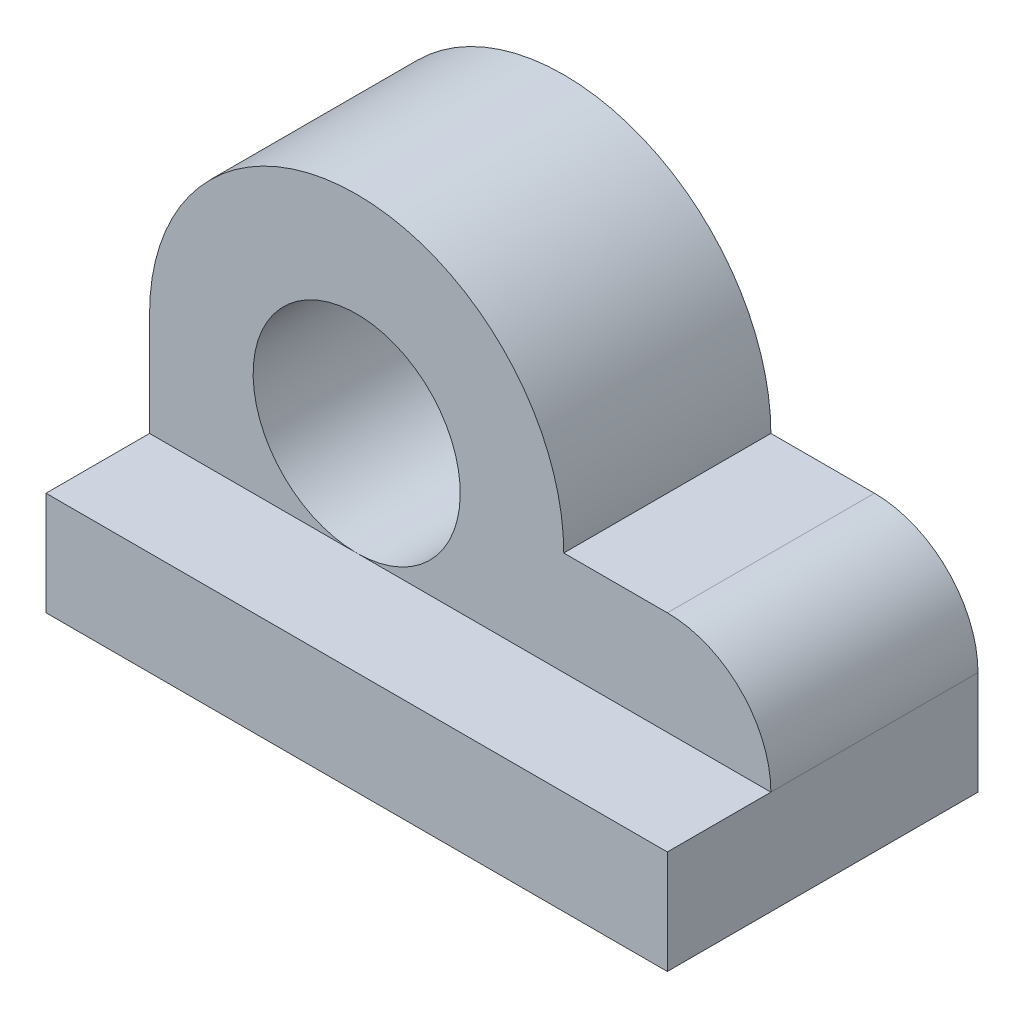
ISO-10303-21;
HEADER;
FILE_DESCRIPTION(('STEP AP214'),'2;1');
FILE_NAME('part.step','',(''),(''),'','','');
FILE_SCHEMA(('AUTOMOTIVE_DESIGN { 1 0 10303 214 1 1 1 1 }'));
ENDSEC;
DATA;
#1=APPLICATION_CONTEXT('core data for automotive mechanical design processes');
#2=APPLICATION_PROTOCOL_DEFINITION('international standard','automotive_design',2000,#1);
#3=PRODUCT_CONTEXT('',#1,'mechanical');
#4=PRODUCT('Part','Part','',(#3));
#5=PRODUCT_RELATED_PRODUCT_CATEGORY('part','',(#4));
#6=PRODUCT_DEFINITION_FORMATION('','',#4);
#7=PRODUCT_DEFINITION_CONTEXT('part definition',#1,'design');
#8=PRODUCT_DEFINITION('design','',#6,#7);
#9=PRODUCT_DEFINITION_SHAPE('','',#8);
#10=(LENGTH_UNIT() NAMED_UNIT(*) SI_UNIT(.MILLI.,.METRE.));
#11=(NAMED_UNIT(*) PLANE_ANGLE_UNIT() SI_UNIT($,.RADIAN.));
#12=(NAMED_UNIT(*) SI_UNIT($,.STERADIAN.) SOLID_ANGLE_UNIT());
#13=UNCERTAINTY_MEASURE_WITH_UNIT(LENGTH_MEASURE(1.E-05),#10,'distance_accuracy_value','');
#14=(GEOMETRIC_REPRESENTATION_CONTEXT(3) GLOBAL_UNCERTAINTY_ASSIGNED_CONTEXT((#13)) GLOBAL_UNIT_ASSIGNED_CONTEXT((#10,
#11,#12)) REPRESENTATION_CONTEXT('',''));
#15=CARTESIAN_POINT('',(0.,0.,0.));
#16=DIRECTION('',(0.,0.,1.));
#17=DIRECTION('',(1.,0.,0.));
#18=AXIS2_PLACEMENT_3D('',#15,#16,#17);
#19=CARTESIAN_POINT('',(20.,0.,10.));
#20=DIRECTION('',(-1.,0.,0.));
#21=DIRECTION('',(0.,0.,1.));
#22=AXIS2_PLACEMENT_3D('',#19,#20,#21);
#23=PLANE('',#22);
#24=DIRECTION('',(0.,1.,0.));
#25=VECTOR('',#24,1.);
#26=CARTESIAN_POINT('',(20.,0.,0.));
#27=LINE('',#26,#25);
#28=CARTESIAN_POINT('',(20.,-10.,0.));
#29=VERTEX_POINT('',#28);
#30=CARTESIAN_POINT('',(20.,-5.00000000000004,0.));
#31=VERTEX_POINT('',#30);
#32=EDGE_CURVE('E140',#29,#31,#27,.T.);
#33=ORIENTED_EDGE('',*,*,#32,.T.);
#34=DIRECTION('',(0.,0.,-1.));
#35=VECTOR('',#34,1.);
#36=CARTESIAN_POINT('',(20.,-5.00000000000004,10.));
#37=LINE('',#36,#35);
#38=CARTESIAN_POINT('',(20.,-5.00000000000004,10.));
#39=VERTEX_POINT('',#38);
#40=EDGE_CURVE('E11',#39,#31,#37,.T.);
#41=ORIENTED_EDGE('',*,*,#40,.F.);
#42=DIRECTION('',(0.,0.,-1.));
#43=VECTOR('',#42,1.);
#44=CARTESIAN_POINT('',(20.,-5.00000000000004,15.));
#45=LINE('',#44,#43);
#46=CARTESIAN_POINT('',(20.,-5.00000000000004,15.));
#47=VERTEX_POINT('',#46);
#48=EDGE_CURVE('E106',#47,#39,#45,.T.);
#49=ORIENTED_EDGE('',*,*,#48,.F.);
#50=DIRECTION('',(0.,1.,0.));
#51=VECTOR('',#50,1.);
#52=CARTESIAN_POINT('',(20.,0.,15.));
#53=LINE('',#52,#51);
#54=CARTESIAN_POINT('',(20.,-10.,15.));
#55=VERTEX_POINT('',#54);
#56=EDGE_CURVE('E120',#55,#47,#53,.T.);
#57=ORIENTED_EDGE('',*,*,#56,.F.);
#58=DIRECTION('',(0.,0.,-1.));
#59=VECTOR('',#58,1.);
#60=CARTESIAN_POINT('',(20.,-10.,10.));
#61=LINE('',#60,#59);
#62=EDGE_CURVE('E139',#55,#29,#61,.T.);
#63=ORIENTED_EDGE('',*,*,#62,.T.);
#64=EDGE_LOOP('',(#33,#41,#49,#57,#63));
#65=FACE_BOUND('',#64,.T.);
#66=ADVANCED_FACE('F35',(#65),#23,.F.);
#67=CARTESIAN_POINT('',(15.,-5.,10.));
#68=DIRECTION('',(0.,0.,-1.));
#69=DIRECTION('',(-1.,0.,0.));
#70=AXIS2_PLACEMENT_3D('',#67,#68,#69);
#71=CYLINDRICAL_SURFACE('',#70,5.);
#72=CARTESIAN_POINT('',(15.,-5.,0.));
#73=DIRECTION('',(0.,0.,1.));
#74=DIRECTION('',(1.,0.,0.));
#75=AXIS2_PLACEMENT_3D('',#72,#73,#74);
#76=CIRCLE('',#75,5.);
#77=CARTESIAN_POINT('',(15.,0.,0.));
#78=VERTEX_POINT('',#77);
#79=EDGE_CURVE('E143',#31,#78,#76,.T.);
#80=ORIENTED_EDGE('',*,*,#79,.T.);
#81=DIRECTION('',(0.,0.,-1.));
#82=VECTOR('',#81,1.);
#83=CARTESIAN_POINT('',(15.,0.,10.));
#84=LINE('',#83,#82);
#85=CARTESIAN_POINT('',(15.,0.,10.));
#86=VERTEX_POINT('',#85);
#87=EDGE_CURVE('E42',#86,#78,#84,.T.);
#88=ORIENTED_EDGE('',*,*,#87,.F.);
#89=CARTESIAN_POINT('',(15.,-5.,10.));
#90=DIRECTION('',(0.,0.,1.));
#91=DIRECTION('',(1.,0.,0.));
#92=AXIS2_PLACEMENT_3D('',#89,#90,#91);
#93=CIRCLE('',#92,5.);
#94=EDGE_CURVE('E129',#39,#86,#93,.T.);
#95=ORIENTED_EDGE('',*,*,#94,.F.);
#96=ORIENTED_EDGE('',*,*,#40,.T.);
#97=EDGE_LOOP('',(#80,#88,#95,#96));
#98=FACE_BOUND('',#97,.T.);
#99=ADVANCED_FACE('F201',(#98),#71,.T.);
#100=CARTESIAN_POINT('',(0.,0.,10.));
#101=DIRECTION('',(0.,-1.,0.));
#102=DIRECTION('',(1.,0.,0.));
#103=AXIS2_PLACEMENT_3D('',#100,#101,#102);
#104=PLANE('',#103);
#105=DIRECTION('',(-1.,0.,0.));
#106=VECTOR('',#105,1.);
#107=CARTESIAN_POINT('',(0.,0.,0.));
#108=LINE('',#107,#106);
#109=CARTESIAN_POINT('',(10.,0.,0.));
#110=VERTEX_POINT('',#109);
#111=EDGE_CURVE('E145',#78,#110,#108,.T.);
#112=ORIENTED_EDGE('',*,*,#111,.T.);
#113=DIRECTION('',(0.,0.,-1.));
#114=VECTOR('',#113,1.);
#115=CARTESIAN_POINT('',(10.,0.,10.));
#116=LINE('',#115,#114);
#117=CARTESIAN_POINT('',(10.,0.,10.));
#118=VERTEX_POINT('',#117);
#119=EDGE_CURVE('E161',#118,#110,#116,.T.);
#120=ORIENTED_EDGE('',*,*,#119,.F.);
#121=DIRECTION('',(-1.,0.,0.));
#122=VECTOR('',#121,1.);
#123=CARTESIAN_POINT('',(0.,0.,10.));
#124=LINE('',#123,#122);
#125=EDGE_CURVE('E131',#86,#118,#124,.T.);
#126=ORIENTED_EDGE('',*,*,#125,.F.);
#127=ORIENTED_EDGE('',*,*,#87,.T.);
#128=EDGE_LOOP('',(#112,#120,#126,#127));
#129=FACE_BOUND('',#128,.T.);
#130=ADVANCED_FACE('F168',(#129),#104,.F.);
#131=CARTESIAN_POINT('',(0.,0.,10.));
#132=DIRECTION('',(0.,0.,-1.));
#133=DIRECTION('',(-1.,0.,0.));
#134=AXIS2_PLACEMENT_3D('',#131,#132,#133);
#135=CYLINDRICAL_SURFACE('',#134,10.);
#136=CARTESIAN_POINT('',(0.,0.,0.));
#137=DIRECTION('',(0.,0.,1.));
#138=DIRECTION('',(1.,0.,0.));
#139=AXIS2_PLACEMENT_3D('',#136,#137,#138);
#140=CIRCLE('',#139,10.);
#141=CARTESIAN_POINT('',(-10.,0.,0.));
#142=VERTEX_POINT('',#141);
#143=EDGE_CURVE('E147',#110,#142,#140,.T.);
#144=ORIENTED_EDGE('',*,*,#143,.T.);
#145=DIRECTION('',(0.,0.,-1.));
#146=VECTOR('',#145,1.);
#147=CARTESIAN_POINT('',(-10.,0.,10.));
#148=LINE('',#147,#146);
#149=CARTESIAN_POINT('',(-10.,0.,10.));
#150=VERTEX_POINT('',#149);
#151=EDGE_CURVE('E158',#150,#142,#148,.T.);
#152=ORIENTED_EDGE('',*,*,#151,.F.);
#153=CARTESIAN_POINT('',(0.,0.,10.));
#154=DIRECTION('',(0.,0.,1.));
#155=DIRECTION('',(1.,0.,0.));
#156=AXIS2_PLACEMENT_3D('',#153,#154,#155);
#157=CIRCLE('',#156,10.);
#158=EDGE_CURVE('E134',#118,#150,#157,.T.);
#159=ORIENTED_EDGE('',*,*,#158,.F.);
#160=ORIENTED_EDGE('',*,*,#119,.T.);
#161=EDGE_LOOP('',(#144,#152,#159,#160));
#162=FACE_BOUND('',#161,.T.);
#163=ADVANCED_FACE('F180',(#162),#135,.T.);
#164=CARTESIAN_POINT('',(-10.,0.,10.));
#165=DIRECTION('',(1.,0.,0.));
#166=DIRECTION('',(0.,0.,-1.));
#167=AXIS2_PLACEMENT_3D('',#164,#165,#166);
#168=PLANE('',#167);
#169=DIRECTION('',(0.,-1.,0.));
#170=VECTOR('',#169,1.);
#171=CARTESIAN_POINT('',(-10.,0.,0.));
#172=LINE('',#171,#170);
#173=CARTESIAN_POINT('',(-10.,-10.,0.));
#174=VERTEX_POINT('',#173);
#175=EDGE_CURVE('E149',#142,#174,#172,.T.);
#176=ORIENTED_EDGE('',*,*,#175,.T.);
#177=DIRECTION('',(0.,0.,-1.));
#178=VECTOR('',#177,1.);
#179=CARTESIAN_POINT('',(-10.,-10.,10.));
#180=LINE('',#179,#178);
#181=CARTESIAN_POINT('',(-10.,-10.,15.));
#182=VERTEX_POINT('',#181);
#183=EDGE_CURVE('E112',#182,#174,#180,.T.);
#184=ORIENTED_EDGE('',*,*,#183,.F.);
#185=DIRECTION('',(0.,-1.,0.));
#186=VECTOR('',#185,1.);
#187=CARTESIAN_POINT('',(-10.,0.,15.));
#188=LINE('',#187,#186);
#189=CARTESIAN_POINT('',(-10.,-5.,15.));
#190=VERTEX_POINT('',#189);
#191=EDGE_CURVE('E109',#190,#182,#188,.T.);
#192=ORIENTED_EDGE('',*,*,#191,.F.);
#193=DIRECTION('',(0.,0.,-1.));
#194=VECTOR('',#193,1.);
#195=CARTESIAN_POINT('',(-10.,-5.,15.));
#196=LINE('',#195,#194);
#197=CARTESIAN_POINT('',(-10.,-5.,10.));
#198=VERTEX_POINT('',#197);
#199=EDGE_CURVE('E98',#190,#198,#196,.T.);
#200=ORIENTED_EDGE('',*,*,#199,.T.);
#201=DIRECTION('',(0.,-1.,0.));
#202=VECTOR('',#201,1.);
#203=CARTESIAN_POINT('',(-10.,0.,10.));
#204=LINE('',#203,#202);
#205=EDGE_CURVE('E54',#150,#198,#204,.T.);
#206=ORIENTED_EDGE('',*,*,#205,.F.);
#207=ORIENTED_EDGE('',*,*,#151,.T.);
#208=EDGE_LOOP('',(#176,#184,#192,#200,#206,#207));
#209=FACE_BOUND('',#208,.T.);
#210=ADVANCED_FACE('F110',(#209),#168,.F.);
#211=CARTESIAN_POINT('',(0.,-10.,10.));
#212=DIRECTION('',(0.,1.,0.));
#213=DIRECTION('',(0.,0.,1.));
#214=AXIS2_PLACEMENT_3D('',#211,#212,#213);
#215=PLANE('',#214);
#216=DIRECTION('',(1.,0.,0.));
#217=VECTOR('',#216,1.);
#218=CARTESIAN_POINT('',(0.,-10.,0.));
#219=LINE('',#218,#217);
#220=EDGE_CURVE('E151',#174,#29,#219,.T.);
#221=ORIENTED_EDGE('',*,*,#220,.T.);
#222=ORIENTED_EDGE('',*,*,#62,.F.);
#223=DIRECTION('',(1.,0.,0.));
#224=VECTOR('',#223,1.);
#225=CARTESIAN_POINT('',(0.,-10.,15.));
#226=LINE('',#225,#224);
#227=EDGE_CURVE('E116',#182,#55,#226,.T.);
#228=ORIENTED_EDGE('',*,*,#227,.F.);
#229=ORIENTED_EDGE('',*,*,#183,.T.);
#230=EDGE_LOOP('',(#221,#222,#228,#229));
#231=FACE_BOUND('',#230,.T.);
#232=ADVANCED_FACE('F183',(#231),#215,.F.);
#233=CARTESIAN_POINT('',(0.,0.,10.));
#234=DIRECTION('',(0.,0.,-1.));
#235=DIRECTION('',(-1.,0.,0.));
#236=AXIS2_PLACEMENT_3D('',#233,#234,#235);
#237=CYLINDRICAL_SURFACE('',#236,5.);
#238=CARTESIAN_POINT('',(0.,0.,0.));
#239=DIRECTION('',(0.,0.,1.));
#240=DIRECTION('',(1.,0.,0.));
#241=AXIS2_PLACEMENT_3D('',#238,#239,#240);
#242=CIRCLE('',#241,5.);
#243=CARTESIAN_POINT('',(5.,0.,0.));
#244=VERTEX_POINT('',#243);
#245=EDGE_CURVE('E132',#244,#244,#242,.T.);
#246=ORIENTED_EDGE('',*,*,#245,.F.);
#247=EDGE_LOOP('',(#246));
#248=FACE_BOUND('',#247,.T.);
#249=CARTESIAN_POINT('',(0.,0.,10.));
#250=DIRECTION('',(0.,0.,1.));
#251=DIRECTION('',(1.,0.,0.));
#252=AXIS2_PLACEMENT_3D('',#249,#250,#251);
#253=CIRCLE('',#252,5.);
#254=CARTESIAN_POINT('',(0.,-5.,10.));
#255=VERTEX_POINT('',#254);
#256=EDGE_CURVE('E137',#255,#255,#253,.T.);
#257=ORIENTED_EDGE('',*,*,#256,.T.);
#258=EDGE_LOOP('',(#257));
#259=FACE_BOUND('',#258,.T.);
#260=ADVANCED_FACE('F188',(#248,#259),#237,.F.);
#261=CARTESIAN_POINT('',(0.,0.,10.));
#262=DIRECTION('',(0.,0.,1.));
#263=DIRECTION('',(1.,0.,0.));
#264=AXIS2_PLACEMENT_3D('',#261,#262,#263);
#265=PLANE('',#264);
#266=DIRECTION('',(-1.,0.,0.));
#267=VECTOR('',#266,1.);
#268=CARTESIAN_POINT('',(0.,-5.,10.));
#269=LINE('',#268,#267);
#270=EDGE_CURVE('E128',#39,#255,#269,.T.);
#271=ORIENTED_EDGE('',*,*,#270,.F.);
#272=ORIENTED_EDGE('',*,*,#94,.T.);
#273=ORIENTED_EDGE('',*,*,#125,.T.);
#274=ORIENTED_EDGE('',*,*,#158,.T.);
#275=ORIENTED_EDGE('',*,*,#205,.T.);
#276=EDGE_CURVE('E49',#255,#198,#269,.T.);
#277=ORIENTED_EDGE('',*,*,#276,.F.);
#278=ORIENTED_EDGE('',*,*,#256,.F.);
#279=EDGE_LOOP('',(#271,#272,#273,#274,#275,#277,#278));
#280=FACE_BOUND('',#279,.T.);
#281=ADVANCED_FACE('F186',(#280),#265,.T.);
#282=CARTESIAN_POINT('',(0.,0.,0.));
#283=DIRECTION('',(0.,0.,1.));
#284=DIRECTION('',(1.,0.,0.));
#285=AXIS2_PLACEMENT_3D('',#282,#283,#284);
#286=PLANE('',#285);
#287=ORIENTED_EDGE('',*,*,#245,.T.);
#288=EDGE_LOOP('',(#287));
#289=FACE_BOUND('',#288,.T.);
#290=ORIENTED_EDGE('',*,*,#79,.F.);
#291=ORIENTED_EDGE('',*,*,#32,.F.);
#292=ORIENTED_EDGE('',*,*,#220,.F.);
#293=ORIENTED_EDGE('',*,*,#175,.F.);
#294=ORIENTED_EDGE('',*,*,#143,.F.);
#295=ORIENTED_EDGE('',*,*,#111,.F.);
#296=EDGE_LOOP('',(#290,#291,#292,#293,#294,#295));
#297=FACE_BOUND('',#296,.T.);
#298=ADVANCED_FACE('F174',(#289,#297),#286,.F.);
#299=CARTESIAN_POINT('',(0.,-5.,15.));
#300=DIRECTION('',(0.,1.,0.));
#301=DIRECTION('',(0.,0.,1.));
#302=AXIS2_PLACEMENT_3D('',#299,#300,#301);
#303=PLANE('',#302);
#304=ORIENTED_EDGE('',*,*,#48,.T.);
#305=ORIENTED_EDGE('',*,*,#270,.T.);
#306=ORIENTED_EDGE('',*,*,#276,.T.);
#307=ORIENTED_EDGE('',*,*,#199,.F.);
#308=DIRECTION('',(1.,0.,0.));
#309=VECTOR('',#308,1.);
#310=CARTESIAN_POINT('',(0.,-5.,15.));
#311=LINE('',#310,#309);
#312=EDGE_CURVE('E103',#190,#47,#311,.T.);
#313=ORIENTED_EDGE('',*,*,#312,.T.);
#314=EDGE_LOOP('',(#304,#305,#306,#307,#313));
#315=FACE_BOUND('',#314,.T.);
#316=ADVANCED_FACE('F101',(#315),#303,.T.);
#317=CARTESIAN_POINT('',(0.,0.,15.));
#318=DIRECTION('',(0.,0.,1.));
#319=DIRECTION('',(1.,0.,0.));
#320=AXIS2_PLACEMENT_3D('',#317,#318,#319);
#321=PLANE('',#320);
#322=ORIENTED_EDGE('',*,*,#312,.F.);
#323=ORIENTED_EDGE('',*,*,#191,.T.);
#324=ORIENTED_EDGE('',*,*,#227,.T.);
#325=ORIENTED_EDGE('',*,*,#56,.T.);
#326=EDGE_LOOP('',(#322,#323,#324,#325));
#327=FACE_BOUND('',#326,.T.);
#328=ADVANCED_FACE('F118',(#327),#321,.T.);
#329=CLOSED_SHELL('',(#66,#99,#130,#163,#210,#232,#260,#281,#298,#316,#328));
#330=MANIFOLD_SOLID_BREP('B2',#329);
#331=ADVANCED_BREP_SHAPE_REPRESENTATION('',(#18,#330),#14);
#332=SHAPE_DEFINITION_REPRESENTATION(#9,#331);
ENDSEC;
END-ISO-10303-21;
